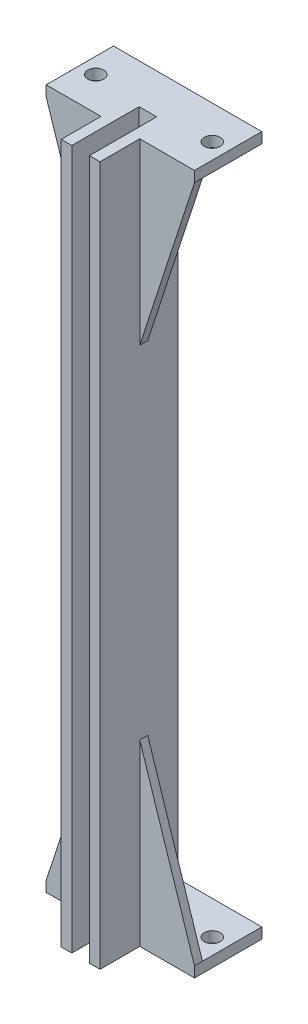
ISO-10303-21;
HEADER;
FILE_DESCRIPTION(('STEP AP214'),'2;1');
FILE_NAME('part.step','',(''),(''),'','','');
FILE_SCHEMA(('AUTOMOTIVE_DESIGN { 1 0 10303 214 1 1 1 1 }'));
ENDSEC;
DATA;
#1=APPLICATION_CONTEXT('core data for automotive mechanical design processes');
#2=APPLICATION_PROTOCOL_DEFINITION('international standard','automotive_design',2000,#1);
#3=PRODUCT_CONTEXT('',#1,'mechanical');
#4=PRODUCT('Part','Part','',(#3));
#5=PRODUCT_RELATED_PRODUCT_CATEGORY('part','',(#4));
#6=PRODUCT_DEFINITION_FORMATION('','',#4);
#7=PRODUCT_DEFINITION_CONTEXT('part definition',#1,'design');
#8=PRODUCT_DEFINITION('design','',#6,#7);
#9=PRODUCT_DEFINITION_SHAPE('','',#8);
#10=(LENGTH_UNIT() NAMED_UNIT(*) SI_UNIT(.MILLI.,.METRE.));
#11=(NAMED_UNIT(*) PLANE_ANGLE_UNIT() SI_UNIT($,.RADIAN.));
#12=(NAMED_UNIT(*) SI_UNIT($,.STERADIAN.) SOLID_ANGLE_UNIT());
#13=UNCERTAINTY_MEASURE_WITH_UNIT(LENGTH_MEASURE(1.E-05),#10,'distance_accuracy_value','');
#14=(GEOMETRIC_REPRESENTATION_CONTEXT(3) GLOBAL_UNCERTAINTY_ASSIGNED_CONTEXT((#13)) GLOBAL_UNIT_ASSIGNED_CONTEXT((#10,
#11,#12)) REPRESENTATION_CONTEXT('',''));
#15=CARTESIAN_POINT('',(0.,0.,0.));
#16=DIRECTION('',(0.,0.,1.));
#17=DIRECTION('',(1.,0.,0.));
#18=AXIS2_PLACEMENT_3D('',#15,#16,#17);
#19=CARTESIAN_POINT('',(-3.6637,2.,0.));
#20=DIRECTION('',(-1.,0.,0.));
#21=DIRECTION('',(0.,0.,1.));
#22=AXIS2_PLACEMENT_3D('',#19,#20,#21);
#23=PLANE('',#22);
#24=DIRECTION('',(0.,0.,1.));
#25=VECTOR('',#24,1.);
#26=CARTESIAN_POINT('',(-3.6637,2.,0.));
#27=LINE('',#26,#25);
#28=CARTESIAN_POINT('',(-3.6637,2.00000000000002,0.));
#29=VERTEX_POINT('',#28);
#30=CARTESIAN_POINT('',(-3.6637,2.,5.6960018));
#31=VERTEX_POINT('',#30);
#32=EDGE_CURVE('E325',#29,#31,#27,.T.);
#33=ORIENTED_EDGE('',*,*,#32,.T.);
#34=DIRECTION('',(0.,-1.,0.));
#35=VECTOR('',#34,1.);
#36=CARTESIAN_POINT('',(-3.6637,2.,5.6960018));
#37=LINE('',#36,#35);
#38=CARTESIAN_POINT('',(-3.6637,33.75,5.6960018));
#39=VERTEX_POINT('',#38);
#40=EDGE_CURVE('E302',#39,#31,#37,.T.);
#41=ORIENTED_EDGE('',*,*,#40,.F.);
#42=DIRECTION('',(0.,0.,1.));
#43=VECTOR('',#42,1.);
#44=CARTESIAN_POINT('',(-3.6637,33.75,5.6960018));
#45=LINE('',#44,#43);
#46=CARTESIAN_POINT('',(-3.6637,33.75,7.1960018));
#47=VERTEX_POINT('',#46);
#48=EDGE_CURVE('E306',#39,#47,#45,.T.);
#49=ORIENTED_EDGE('',*,*,#48,.T.);
#50=DIRECTION('',(0.,-1.,0.));
#51=VECTOR('',#50,1.);
#52=CARTESIAN_POINT('',(-3.6637,2.,7.1960018));
#53=LINE('',#52,#51);
#54=CARTESIAN_POINT('',(-3.6637,0.,7.1960018));
#55=VERTEX_POINT('',#54);
#56=EDGE_CURVE('E433',#47,#55,#53,.T.);
#57=ORIENTED_EDGE('',*,*,#56,.T.);
#58=DIRECTION('',(0.,0.,-1.));
#59=VECTOR('',#58,1.);
#60=CARTESIAN_POINT('',(-3.6637,0.,0.));
#61=LINE('',#60,#59);
#62=CARTESIAN_POINT('',(-3.6637,0.,14.7));
#63=VERTEX_POINT('',#62);
#64=EDGE_CURVE('E371',#63,#55,#61,.T.);
#65=ORIENTED_EDGE('',*,*,#64,.F.);
#66=DIRECTION('',(0.,-1.,0.));
#67=VECTOR('',#66,1.);
#68=CARTESIAN_POINT('',(-3.6637,2.,14.7));
#69=LINE('',#68,#67);
#70=CARTESIAN_POINT('',(-3.6637,132.08,14.7));
#71=VERTEX_POINT('',#70);
#72=EDGE_CURVE('E430',#71,#63,#69,.T.);
#73=ORIENTED_EDGE('',*,*,#72,.F.);
#74=DIRECTION('',(0.,0.,-1.));
#75=VECTOR('',#74,1.);
#76=CARTESIAN_POINT('',(-3.6637,132.08,0.));
#77=LINE('',#76,#75);
#78=CARTESIAN_POINT('',(-3.6637,132.08,7.1960018));
#79=VERTEX_POINT('',#78);
#80=EDGE_CURVE('E1096',#71,#79,#77,.T.);
#81=ORIENTED_EDGE('',*,*,#80,.T.);
#82=DIRECTION('',(0.,1.,0.));
#83=VECTOR('',#82,1.);
#84=CARTESIAN_POINT('',(-3.6637,130.08,7.1960018));
#85=LINE('',#84,#83);
#86=CARTESIAN_POINT('',(-3.6637,98.33,7.1960018));
#87=VERTEX_POINT('',#86);
#88=EDGE_CURVE('E251',#87,#79,#85,.T.);
#89=ORIENTED_EDGE('',*,*,#88,.F.);
#90=DIRECTION('',(0.,0.,1.));
#91=VECTOR('',#90,1.);
#92=CARTESIAN_POINT('',(-3.6637,98.33,5.6960018));
#93=LINE('',#92,#91);
#94=CARTESIAN_POINT('',(-3.6637,98.33,5.6960018));
#95=VERTEX_POINT('',#94);
#96=EDGE_CURVE('E1052',#95,#87,#93,.T.);
#97=ORIENTED_EDGE('',*,*,#96,.F.);
#98=DIRECTION('',(0.,1.,0.));
#99=VECTOR('',#98,1.);
#100=CARTESIAN_POINT('',(-3.6637,130.08,5.6960018));
#101=LINE('',#100,#99);
#102=CARTESIAN_POINT('',(-3.6637,130.08,5.6960018));
#103=VERTEX_POINT('',#102);
#104=EDGE_CURVE('E1048',#95,#103,#101,.T.);
#105=ORIENTED_EDGE('',*,*,#104,.T.);
#106=DIRECTION('',(0.,0.,1.));
#107=VECTOR('',#106,1.);
#108=CARTESIAN_POINT('',(-3.6637,130.08,0.));
#109=LINE('',#108,#107);
#110=CARTESIAN_POINT('',(-3.6637,130.08,0.));
#111=VERTEX_POINT('',#110);
#112=EDGE_CURVE('E1062',#111,#103,#109,.T.);
#113=ORIENTED_EDGE('',*,*,#112,.F.);
#114=DIRECTION('',(0.,-1.,0.));
#115=VECTOR('',#114,1.);
#116=CARTESIAN_POINT('',(-3.6637,38.1,0.));
#117=LINE('',#116,#115);
#118=EDGE_CURVE('E317',#111,#29,#117,.T.);
#119=ORIENTED_EDGE('',*,*,#118,.T.);
#120=EDGE_LOOP('',(#33,#41,#49,#57,#65,#73,#81,#89,#97,#105,#113,#119));
#121=FACE_BOUND('',#120,.T.);
#122=ADVANCED_FACE('F43',(#121),#23,.T.);
#123=CARTESIAN_POINT('',(0.,2.,0.));
#124=DIRECTION('',(0.,1.,0.));
#125=DIRECTION('',(0.,0.,1.));
#126=AXIS2_PLACEMENT_3D('',#123,#124,#125);
#127=PLANE('',#126);
#128=DIRECTION('',(-1.,0.,0.));
#129=VECTOR('',#128,1.);
#130=CARTESIAN_POINT('',(14.,2.,5.6960018));
#131=LINE('',#130,#129);
#132=CARTESIAN_POINT('',(14.,2.,5.6960018));
#133=VERTEX_POINT('',#132);
#134=CARTESIAN_POINT('',(3.6637,2.,5.6960018));
#135=VERTEX_POINT('',#134);
#136=EDGE_CURVE('E59',#133,#135,#131,.T.);
#137=ORIENTED_EDGE('',*,*,#136,.F.);
#138=DIRECTION('',(0.,0.,1.));
#139=VECTOR('',#138,1.);
#140=CARTESIAN_POINT('',(14.,2.,0.));
#141=LINE('',#140,#139);
#142=CARTESIAN_POINT('',(14.,2.,-5.5039982));
#143=VERTEX_POINT('',#142);
#144=EDGE_CURVE('E336',#143,#133,#141,.T.);
#145=ORIENTED_EDGE('',*,*,#144,.F.);
#146=DIRECTION('',(1.,0.,0.));
#147=VECTOR('',#146,1.);
#148=CARTESIAN_POINT('',(0.,2.,-5.5039982));
#149=LINE('',#148,#147);
#150=CARTESIAN_POINT('',(-14.,2.,-5.5039982));
#151=VERTEX_POINT('',#150);
#152=EDGE_CURVE('E339',#151,#143,#149,.T.);
#153=ORIENTED_EDGE('',*,*,#152,.F.);
#154=DIRECTION('',(0.,0.,1.));
#155=VECTOR('',#154,1.);
#156=CARTESIAN_POINT('',(-14.,2.,0.));
#157=LINE('',#156,#155);
#158=CARTESIAN_POINT('',(-14.,2.,5.6960018));
#159=VERTEX_POINT('',#158);
#160=EDGE_CURVE('E344',#151,#159,#157,.T.);
#161=ORIENTED_EDGE('',*,*,#160,.T.);
#162=DIRECTION('',(-1.,0.,0.));
#163=VECTOR('',#162,1.);
#164=CARTESIAN_POINT('',(-14.,2.,5.6960018));
#165=LINE('',#164,#163);
#166=EDGE_CURVE('E294',#31,#159,#165,.T.);
#167=ORIENTED_EDGE('',*,*,#166,.F.);
#168=ORIENTED_EDGE('',*,*,#32,.F.);
#169=DIRECTION('',(-1.,0.,0.));
#170=VECTOR('',#169,1.);
#171=CARTESIAN_POINT('',(0.,2.,0.));
#172=LINE('',#171,#170);
#173=CARTESIAN_POINT('',(3.6637,2.00000000000002,0.));
#174=VERTEX_POINT('',#173);
#175=EDGE_CURVE('E329',#174,#29,#172,.T.);
#176=ORIENTED_EDGE('',*,*,#175,.F.);
#177=DIRECTION('',(0.,0.,-1.));
#178=VECTOR('',#177,1.);
#179=CARTESIAN_POINT('',(3.6637,2.,0.));
#180=LINE('',#179,#178);
#181=EDGE_CURVE('E332',#135,#174,#180,.T.);
#182=ORIENTED_EDGE('',*,*,#181,.F.);
#183=EDGE_LOOP('',(#137,#145,#153,#161,#167,#168,#176,#182));
#184=FACE_BOUND('',#183,.T.);
#185=CARTESIAN_POINT('',(-11.,2.,0.846001800000001));
#186=DIRECTION('',(0.,1.,0.));
#187=DIRECTION('',(0.,0.,1.));
#188=AXIS2_PLACEMENT_3D('',#185,#186,#187);
#189=CIRCLE('',#188,1.5);
#190=CARTESIAN_POINT('',(-11.,2.,2.3460018));
#191=VERTEX_POINT('',#190);
#192=EDGE_CURVE('E348',#191,#191,#189,.T.);
#193=ORIENTED_EDGE('',*,*,#192,.F.);
#194=EDGE_LOOP('',(#193));
#195=FACE_BOUND('',#194,.T.);
#196=CARTESIAN_POINT('',(11.,2.,0.846001800000001));
#197=DIRECTION('',(0.,1.,0.));
#198=DIRECTION('',(0.,0.,1.));
#199=AXIS2_PLACEMENT_3D('',#196,#197,#198);
#200=CIRCLE('',#199,1.5);
#201=CARTESIAN_POINT('',(11.,2.,2.3460018));
#202=VERTEX_POINT('',#201);
#203=EDGE_CURVE('E352',#202,#202,#200,.T.);
#204=ORIENTED_EDGE('',*,*,#203,.F.);
#205=EDGE_LOOP('',(#204));
#206=FACE_BOUND('',#205,.T.);
#207=ADVANCED_FACE('F499',(#184,#195,#206),#127,.T.);
#208=CARTESIAN_POINT('',(14.,2.,0.));
#209=DIRECTION('',(1.,0.,0.));
#210=DIRECTION('',(0.,0.,-1.));
#211=AXIS2_PLACEMENT_3D('',#208,#209,#210);
#212=PLANE('',#211);
#213=DIRECTION('',(0.,0.,1.));
#214=VECTOR('',#213,1.);
#215=CARTESIAN_POINT('',(14.,0.,0.));
#216=LINE('',#215,#214);
#217=CARTESIAN_POINT('',(14.,0.,-5.5039982));
#218=VERTEX_POINT('',#217);
#219=CARTESIAN_POINT('',(14.,0.,7.1960018));
#220=VERTEX_POINT('',#219);
#221=EDGE_CURVE('E335',#218,#220,#216,.T.);
#222=ORIENTED_EDGE('',*,*,#221,.F.);
#223=DIRECTION('',(0.,-1.,0.));
#224=VECTOR('',#223,1.);
#225=CARTESIAN_POINT('',(14.,2.,-5.5039982));
#226=LINE('',#225,#224);
#227=EDGE_CURVE('E11',#143,#218,#226,.T.);
#228=ORIENTED_EDGE('',*,*,#227,.F.);
#229=ORIENTED_EDGE('',*,*,#144,.T.);
#230=DIRECTION('',(0.,0.,1.));
#231=VECTOR('',#230,1.);
#232=CARTESIAN_POINT('',(14.,2.,5.6960018));
#233=LINE('',#232,#231);
#234=CARTESIAN_POINT('',(14.,2.,7.1960018));
#235=VERTEX_POINT('',#234);
#236=EDGE_CURVE('E289',#133,#235,#233,.T.);
#237=ORIENTED_EDGE('',*,*,#236,.T.);
#238=DIRECTION('',(0.,-1.,0.));
#239=VECTOR('',#238,1.);
#240=CARTESIAN_POINT('',(14.,2.,7.1960018));
#241=LINE('',#240,#239);
#242=EDGE_CURVE('E356',#235,#220,#241,.T.);
#243=ORIENTED_EDGE('',*,*,#242,.T.);
#244=EDGE_LOOP('',(#222,#228,#229,#237,#243));
#245=FACE_BOUND('',#244,.T.);
#246=ADVANCED_FACE('F45',(#245),#212,.T.);
#247=CARTESIAN_POINT('',(0.,2.,-5.5039982));
#248=DIRECTION('',(0.,0.,-1.));
#249=DIRECTION('',(-1.,0.,0.));
#250=AXIS2_PLACEMENT_3D('',#247,#248,#249);
#251=PLANE('',#250);
#252=DIRECTION('',(1.,0.,0.));
#253=VECTOR('',#252,1.);
#254=CARTESIAN_POINT('',(0.,0.,-5.5039982));
#255=LINE('',#254,#253);
#256=CARTESIAN_POINT('',(-14.,0.,-5.5039982));
#257=VERTEX_POINT('',#256);
#258=EDGE_CURVE('E360',#257,#218,#255,.T.);
#259=ORIENTED_EDGE('',*,*,#258,.F.);
#260=DIRECTION('',(0.,-1.,0.));
#261=VECTOR('',#260,1.);
#262=CARTESIAN_POINT('',(-14.,2.,-5.5039982));
#263=LINE('',#262,#261);
#264=EDGE_CURVE('E52',#151,#257,#263,.T.);
#265=ORIENTED_EDGE('',*,*,#264,.F.);
#266=ORIENTED_EDGE('',*,*,#152,.T.);
#267=ORIENTED_EDGE('',*,*,#227,.T.);
#268=EDGE_LOOP('',(#259,#265,#266,#267));
#269=FACE_BOUND('',#268,.T.);
#270=ADVANCED_FACE('F452',(#269),#251,.T.);
#271=CARTESIAN_POINT('',(-14.,2.,0.));
#272=DIRECTION('',(1.,0.,0.));
#273=DIRECTION('',(0.,0.,-1.));
#274=AXIS2_PLACEMENT_3D('',#271,#272,#273);
#275=PLANE('',#274);
#276=DIRECTION('',(0.,0.,1.));
#277=VECTOR('',#276,1.);
#278=CARTESIAN_POINT('',(-14.,0.,0.));
#279=LINE('',#278,#277);
#280=CARTESIAN_POINT('',(-14.,0.,7.1960018));
#281=VERTEX_POINT('',#280);
#282=EDGE_CURVE('E364',#257,#281,#279,.T.);
#283=ORIENTED_EDGE('',*,*,#282,.T.);
#284=DIRECTION('',(0.,-1.,0.));
#285=VECTOR('',#284,1.);
#286=CARTESIAN_POINT('',(-14.,2.,7.1960018));
#287=LINE('',#286,#285);
#288=CARTESIAN_POINT('',(-14.,2.,7.1960018));
#289=VERTEX_POINT('',#288);
#290=EDGE_CURVE('E436',#289,#281,#287,.T.);
#291=ORIENTED_EDGE('',*,*,#290,.F.);
#292=DIRECTION('',(0.,0.,1.));
#293=VECTOR('',#292,1.);
#294=CARTESIAN_POINT('',(-14.,2.,5.6960018));
#295=LINE('',#294,#293);
#296=EDGE_CURVE('E313',#159,#289,#295,.T.);
#297=ORIENTED_EDGE('',*,*,#296,.F.);
#298=ORIENTED_EDGE('',*,*,#160,.F.);
#299=ORIENTED_EDGE('',*,*,#264,.T.);
#300=EDGE_LOOP('',(#283,#291,#297,#298,#299));
#301=FACE_BOUND('',#300,.T.);
#302=ADVANCED_FACE('F443',(#301),#275,.F.);
#303=CARTESIAN_POINT('',(0.,2.,7.1960018));
#304=DIRECTION('',(0.,0.,-1.));
#305=DIRECTION('',(-1.,0.,0.));
#306=AXIS2_PLACEMENT_3D('',#303,#304,#305);
#307=PLANE('',#306);
#308=DIRECTION('',(1.,0.,0.));
#309=VECTOR('',#308,1.);
#310=CARTESIAN_POINT('',(0.,0.,7.1960018));
#311=LINE('',#310,#309);
#312=EDGE_CURVE('E367',#281,#55,#311,.T.);
#313=ORIENTED_EDGE('',*,*,#312,.T.);
#314=ORIENTED_EDGE('',*,*,#56,.F.);
#315=DIRECTION('',(0.309561424772771,0.950879447823252,0.));
#316=VECTOR('',#315,1.);
#317=CARTESIAN_POINT('',(-3.6637,33.75,7.1960018));
#318=LINE('',#317,#316);
#319=EDGE_CURVE('E293',#289,#47,#318,.T.);
#320=ORIENTED_EDGE('',*,*,#319,.F.);
#321=ORIENTED_EDGE('',*,*,#290,.T.);
#322=EDGE_LOOP('',(#313,#314,#320,#321));
#323=FACE_BOUND('',#322,.T.);
#324=ADVANCED_FACE('F496',(#323),#307,.F.);
#325=CARTESIAN_POINT('',(0.,2.,14.7));
#326=DIRECTION('',(0.,0.,1.));
#327=DIRECTION('',(1.,0.,0.));
#328=AXIS2_PLACEMENT_3D('',#325,#326,#327);
#329=PLANE('',#328);
#330=DIRECTION('',(-1.,0.,0.));
#331=VECTOR('',#330,1.);
#332=CARTESIAN_POINT('',(0.,0.,14.7));
#333=LINE('',#332,#331);
#334=CARTESIAN_POINT('',(-1.6637,0.,14.7));
#335=VERTEX_POINT('',#334);
#336=EDGE_CURVE('E375',#335,#63,#333,.T.);
#337=ORIENTED_EDGE('',*,*,#336,.F.);
#338=DIRECTION('',(0.,-1.,0.));
#339=VECTOR('',#338,1.);
#340=CARTESIAN_POINT('',(-1.6637,2.,14.7));
#341=LINE('',#340,#339);
#342=CARTESIAN_POINT('',(-1.6637,132.08,14.7));
#343=VERTEX_POINT('',#342);
#344=EDGE_CURVE('E427',#343,#335,#341,.T.);
#345=ORIENTED_EDGE('',*,*,#344,.F.);
#346=DIRECTION('',(-1.,0.,0.));
#347=VECTOR('',#346,1.);
#348=CARTESIAN_POINT('',(0.,132.08,14.7));
#349=LINE('',#348,#347);
#350=EDGE_CURVE('E489',#343,#71,#349,.T.);
#351=ORIENTED_EDGE('',*,*,#350,.T.);
#352=ORIENTED_EDGE('',*,*,#72,.T.);
#353=EDGE_LOOP('',(#337,#345,#351,#352));
#354=FACE_BOUND('',#353,.T.);
#355=ADVANCED_FACE('F486',(#354),#329,.T.);
#356=CARTESIAN_POINT('',(-1.6637,2.,0.));
#357=DIRECTION('',(1.,0.,0.));
#358=DIRECTION('',(0.,0.,-1.));
#359=AXIS2_PLACEMENT_3D('',#356,#357,#358);
#360=PLANE('',#359);
#361=DIRECTION('',(0.,0.,1.));
#362=VECTOR('',#361,1.);
#363=CARTESIAN_POINT('',(-1.6637,0.,0.));
#364=LINE('',#363,#362);
#365=CARTESIAN_POINT('',(-1.6637,0.,2.));
#366=VERTEX_POINT('',#365);
#367=EDGE_CURVE('E379',#366,#335,#364,.T.);
#368=ORIENTED_EDGE('',*,*,#367,.F.);
#369=DIRECTION('',(0.,-1.,0.));
#370=VECTOR('',#369,1.);
#371=CARTESIAN_POINT('',(-1.6637,2.,2.));
#372=LINE('',#371,#370);
#373=CARTESIAN_POINT('',(-1.6637,132.08,2.));
#374=VERTEX_POINT('',#373);
#375=EDGE_CURVE('E424',#374,#366,#372,.T.);
#376=ORIENTED_EDGE('',*,*,#375,.F.);
#377=DIRECTION('',(0.,0.,1.));
#378=VECTOR('',#377,1.);
#379=CARTESIAN_POINT('',(-1.6637,132.08,0.));
#380=LINE('',#379,#378);
#381=EDGE_CURVE('E1101',#374,#343,#380,.T.);
#382=ORIENTED_EDGE('',*,*,#381,.T.);
#383=ORIENTED_EDGE('',*,*,#344,.T.);
#384=EDGE_LOOP('',(#368,#376,#382,#383));
#385=FACE_BOUND('',#384,.T.);
#386=ADVANCED_FACE('F482',(#385),#360,.T.);
#387=CARTESIAN_POINT('',(0.,2.,2.));
#388=DIRECTION('',(0.,0.,1.));
#389=DIRECTION('',(1.,0.,0.));
#390=AXIS2_PLACEMENT_3D('',#387,#388,#389);
#391=PLANE('',#390);
#392=DIRECTION('',(-1.,0.,0.));
#393=VECTOR('',#392,1.);
#394=CARTESIAN_POINT('',(0.,0.,2.));
#395=LINE('',#394,#393);
#396=CARTESIAN_POINT('',(1.6637,0.,2.));
#397=VERTEX_POINT('',#396);
#398=EDGE_CURVE('E383',#397,#366,#395,.T.);
#399=ORIENTED_EDGE('',*,*,#398,.F.);
#400=DIRECTION('',(0.,-1.,0.));
#401=VECTOR('',#400,1.);
#402=CARTESIAN_POINT('',(1.6637,2.,2.));
#403=LINE('',#402,#401);
#404=CARTESIAN_POINT('',(1.6637,132.08,2.));
#405=VERTEX_POINT('',#404);
#406=EDGE_CURVE('E421',#405,#397,#403,.T.);
#407=ORIENTED_EDGE('',*,*,#406,.F.);
#408=DIRECTION('',(-1.,0.,0.));
#409=VECTOR('',#408,1.);
#410=CARTESIAN_POINT('',(0.,132.08,2.));
#411=LINE('',#410,#409);
#412=EDGE_CURVE('E478',#405,#374,#411,.T.);
#413=ORIENTED_EDGE('',*,*,#412,.T.);
#414=ORIENTED_EDGE('',*,*,#375,.T.);
#415=EDGE_LOOP('',(#399,#407,#413,#414));
#416=FACE_BOUND('',#415,.T.);
#417=ADVANCED_FACE('F476',(#416),#391,.T.);
#418=CARTESIAN_POINT('',(1.6637,2.,0.));
#419=DIRECTION('',(-1.,0.,0.));
#420=DIRECTION('',(0.,0.,1.));
#421=AXIS2_PLACEMENT_3D('',#418,#419,#420);
#422=PLANE('',#421);
#423=DIRECTION('',(0.,0.,-1.));
#424=VECTOR('',#423,1.);
#425=CARTESIAN_POINT('',(1.6637,0.,0.));
#426=LINE('',#425,#424);
#427=CARTESIAN_POINT('',(1.6637,0.,14.7));
#428=VERTEX_POINT('',#427);
#429=EDGE_CURVE('E387',#428,#397,#426,.T.);
#430=ORIENTED_EDGE('',*,*,#429,.F.);
#431=DIRECTION('',(0.,-1.,0.));
#432=VECTOR('',#431,1.);
#433=CARTESIAN_POINT('',(1.6637,2.,14.7));
#434=LINE('',#433,#432);
#435=CARTESIAN_POINT('',(1.6637,132.08,14.7));
#436=VERTEX_POINT('',#435);
#437=EDGE_CURVE('E418',#436,#428,#434,.T.);
#438=ORIENTED_EDGE('',*,*,#437,.F.);
#439=DIRECTION('',(0.,0.,-1.));
#440=VECTOR('',#439,1.);
#441=CARTESIAN_POINT('',(1.6637,132.08,0.));
#442=LINE('',#441,#440);
#443=EDGE_CURVE('E472',#436,#405,#442,.T.);
#444=ORIENTED_EDGE('',*,*,#443,.T.);
#445=ORIENTED_EDGE('',*,*,#406,.T.);
#446=EDGE_LOOP('',(#430,#438,#444,#445));
#447=FACE_BOUND('',#446,.T.);
#448=ADVANCED_FACE('F469',(#447),#422,.T.);
#449=CARTESIAN_POINT('',(0.,2.,14.7));
#450=DIRECTION('',(0.,0.,1.));
#451=DIRECTION('',(1.,0.,0.));
#452=AXIS2_PLACEMENT_3D('',#449,#450,#451);
#453=PLANE('',#452);
#454=DIRECTION('',(-1.,0.,0.));
#455=VECTOR('',#454,1.);
#456=CARTESIAN_POINT('',(0.,0.,14.7));
#457=LINE('',#456,#455);
#458=CARTESIAN_POINT('',(3.6637,0.,14.7));
#459=VERTEX_POINT('',#458);
#460=EDGE_CURVE('E391',#459,#428,#457,.T.);
#461=ORIENTED_EDGE('',*,*,#460,.F.);
#462=DIRECTION('',(0.,-1.,0.));
#463=VECTOR('',#462,1.);
#464=CARTESIAN_POINT('',(3.6637,2.,14.7));
#465=LINE('',#464,#463);
#466=CARTESIAN_POINT('',(3.6637,132.08,14.7));
#467=VERTEX_POINT('',#466);
#468=EDGE_CURVE('E415',#467,#459,#465,.T.);
#469=ORIENTED_EDGE('',*,*,#468,.F.);
#470=DIRECTION('',(-1.,0.,0.));
#471=VECTOR('',#470,1.);
#472=CARTESIAN_POINT('',(0.,132.08,14.7));
#473=LINE('',#472,#471);
#474=EDGE_CURVE('E1108',#467,#436,#473,.T.);
#475=ORIENTED_EDGE('',*,*,#474,.T.);
#476=ORIENTED_EDGE('',*,*,#437,.T.);
#477=EDGE_LOOP('',(#461,#469,#475,#476));
#478=FACE_BOUND('',#477,.T.);
#479=ADVANCED_FACE('F465',(#478),#453,.T.);
#480=CARTESIAN_POINT('',(3.6637,2.,0.));
#481=DIRECTION('',(1.,0.,0.));
#482=DIRECTION('',(0.,0.,-1.));
#483=AXIS2_PLACEMENT_3D('',#480,#481,#482);
#484=PLANE('',#483);
#485=DIRECTION('',(0.,1.,0.));
#486=VECTOR('',#485,1.);
#487=CARTESIAN_POINT('',(3.6637,2.,5.6960018));
#488=LINE('',#487,#486);
#489=CARTESIAN_POINT('',(3.6637,33.75,5.6960018));
#490=VERTEX_POINT('',#489);
#491=EDGE_CURVE('E281',#135,#490,#488,.T.);
#492=ORIENTED_EDGE('',*,*,#491,.F.);
#493=ORIENTED_EDGE('',*,*,#181,.T.);
#494=DIRECTION('',(0.,-1.,0.));
#495=VECTOR('',#494,1.);
#496=CARTESIAN_POINT('',(3.6637,38.1,0.));
#497=LINE('',#496,#495);
#498=CARTESIAN_POINT('',(3.6637,130.08,0.));
#499=VERTEX_POINT('',#498);
#500=EDGE_CURVE('E321',#499,#174,#497,.T.);
#501=ORIENTED_EDGE('',*,*,#500,.F.);
#502=DIRECTION('',(0.,0.,-1.));
#503=VECTOR('',#502,1.);
#504=CARTESIAN_POINT('',(3.6637,130.08,0.));
#505=LINE('',#504,#503);
#506=CARTESIAN_POINT('',(3.6637,130.08,5.6960018));
#507=VERTEX_POINT('',#506);
#508=EDGE_CURVE('E515',#507,#499,#505,.T.);
#509=ORIENTED_EDGE('',*,*,#508,.F.);
#510=DIRECTION('',(0.,-1.,0.));
#511=VECTOR('',#510,1.);
#512=CARTESIAN_POINT('',(3.6637,130.08,5.6960018));
#513=LINE('',#512,#511);
#514=CARTESIAN_POINT('',(3.6637,98.33,5.6960018));
#515=VERTEX_POINT('',#514);
#516=EDGE_CURVE('E1030',#507,#515,#513,.T.);
#517=ORIENTED_EDGE('',*,*,#516,.T.);
#518=DIRECTION('',(0.,0.,1.));
#519=VECTOR('',#518,1.);
#520=CARTESIAN_POINT('',(3.6637,98.33,5.6960018));
#521=LINE('',#520,#519);
#522=CARTESIAN_POINT('',(3.6637,98.33,7.1960018));
#523=VERTEX_POINT('',#522);
#524=EDGE_CURVE('E240',#515,#523,#521,.T.);
#525=ORIENTED_EDGE('',*,*,#524,.T.);
#526=DIRECTION('',(0.,1.,0.));
#527=VECTOR('',#526,1.);
#528=CARTESIAN_POINT('',(3.6637,130.08,7.1960018));
#529=LINE('',#528,#527);
#530=CARTESIAN_POINT('',(3.6637,132.08,7.1960018));
#531=VERTEX_POINT('',#530);
#532=EDGE_CURVE('E225',#523,#531,#529,.T.);
#533=ORIENTED_EDGE('',*,*,#532,.T.);
#534=DIRECTION('',(0.,0.,1.));
#535=VECTOR('',#534,1.);
#536=CARTESIAN_POINT('',(3.6637,132.08,0.));
#537=LINE('',#536,#535);
#538=EDGE_CURVE('E461',#531,#467,#537,.T.);
#539=ORIENTED_EDGE('',*,*,#538,.T.);
#540=ORIENTED_EDGE('',*,*,#468,.T.);
#541=DIRECTION('',(0.,0.,1.));
#542=VECTOR('',#541,1.);
#543=CARTESIAN_POINT('',(3.6637,0.,0.));
#544=LINE('',#543,#542);
#545=CARTESIAN_POINT('',(3.6637,0.,7.1960018));
#546=VERTEX_POINT('',#545);
#547=EDGE_CURVE('E395',#546,#459,#544,.T.);
#548=ORIENTED_EDGE('',*,*,#547,.F.);
#549=DIRECTION('',(0.,-1.,0.));
#550=VECTOR('',#549,1.);
#551=CARTESIAN_POINT('',(3.6637,2.,7.1960018));
#552=LINE('',#551,#550);
#553=CARTESIAN_POINT('',(3.6637,33.75,7.1960018));
#554=VERTEX_POINT('',#553);
#555=EDGE_CURVE('E412',#554,#546,#552,.T.);
#556=ORIENTED_EDGE('',*,*,#555,.F.);
#557=DIRECTION('',(0.,0.,1.));
#558=VECTOR('',#557,1.);
#559=CARTESIAN_POINT('',(3.6637,33.75,5.6960018));
#560=LINE('',#559,#558);
#561=EDGE_CURVE('E67',#490,#554,#560,.T.);
#562=ORIENTED_EDGE('',*,*,#561,.F.);
#563=EDGE_LOOP('',(#492,#493,#501,#509,#517,#525,#533,#539,#540,#548,#556,#562));
#564=FACE_BOUND('',#563,.T.);
#565=ADVANCED_FACE('F457',(#564),#484,.T.);
#566=CARTESIAN_POINT('',(-11.,2.,0.846001800000001));
#567=DIRECTION('',(0.,-1.,0.));
#568=DIRECTION('',(0.,0.,-1.));
#569=AXIS2_PLACEMENT_3D('',#566,#567,#568);
#570=CYLINDRICAL_SURFACE('',#569,1.5);
#571=ORIENTED_EDGE('',*,*,#192,.T.);
#572=EDGE_LOOP('',(#571));
#573=FACE_BOUND('',#572,.T.);
#574=CARTESIAN_POINT('',(-11.,0.,0.846001800000001));
#575=DIRECTION('',(0.,1.,0.));
#576=DIRECTION('',(0.,0.,1.));
#577=AXIS2_PLACEMENT_3D('',#574,#575,#576);
#578=CIRCLE('',#577,1.5);
#579=CARTESIAN_POINT('',(-11.,0.,2.3460018));
#580=VERTEX_POINT('',#579);
#581=EDGE_CURVE('E403',#580,#580,#578,.T.);
#582=ORIENTED_EDGE('',*,*,#581,.F.);
#583=EDGE_LOOP('',(#582));
#584=FACE_BOUND('',#583,.T.);
#585=ADVANCED_FACE('F527',(#573,#584),#570,.F.);
#586=CARTESIAN_POINT('',(0.,2.,7.1960018));
#587=DIRECTION('',(0.,0.,-1.));
#588=DIRECTION('',(-1.,0.,0.));
#589=AXIS2_PLACEMENT_3D('',#586,#587,#588);
#590=PLANE('',#589);
#591=DIRECTION('',(1.,0.,0.));
#592=VECTOR('',#591,1.);
#593=CARTESIAN_POINT('',(0.,0.,7.1960018));
#594=LINE('',#593,#592);
#595=EDGE_CURVE('E399',#546,#220,#594,.T.);
#596=ORIENTED_EDGE('',*,*,#595,.T.);
#597=ORIENTED_EDGE('',*,*,#242,.F.);
#598=DIRECTION('',(0.309561424772771,-0.950879447823252,0.));
#599=VECTOR('',#598,1.);
#600=CARTESIAN_POINT('',(3.6637,33.75,7.1960018));
#601=LINE('',#600,#599);
#602=EDGE_CURVE('E274',#554,#235,#601,.T.);
#603=ORIENTED_EDGE('',*,*,#602,.F.);
#604=ORIENTED_EDGE('',*,*,#555,.T.);
#605=EDGE_LOOP('',(#596,#597,#603,#604));
#606=FACE_BOUND('',#605,.T.);
#607=ADVANCED_FACE('F524',(#606),#590,.F.);
#608=CARTESIAN_POINT('',(11.,2.,0.846001800000001));
#609=DIRECTION('',(0.,-1.,0.));
#610=DIRECTION('',(0.,0.,-1.));
#611=AXIS2_PLACEMENT_3D('',#608,#609,#610);
#612=CYLINDRICAL_SURFACE('',#611,1.5);
#613=ORIENTED_EDGE('',*,*,#203,.T.);
#614=EDGE_LOOP('',(#613));
#615=FACE_BOUND('',#614,.T.);
#616=CARTESIAN_POINT('',(11.,0.,0.846001800000001));
#617=DIRECTION('',(0.,1.,0.));
#618=DIRECTION('',(0.,0.,1.));
#619=AXIS2_PLACEMENT_3D('',#616,#617,#618);
#620=CIRCLE('',#619,1.5);
#621=CARTESIAN_POINT('',(11.,0.,2.3460018));
#622=VERTEX_POINT('',#621);
#623=EDGE_CURVE('E340',#622,#622,#620,.T.);
#624=ORIENTED_EDGE('',*,*,#623,.F.);
#625=EDGE_LOOP('',(#624));
#626=FACE_BOUND('',#625,.T.);
#627=ADVANCED_FACE('F526',(#615,#626),#612,.F.);
#628=CARTESIAN_POINT('',(0.,0.,0.));
#629=DIRECTION('',(0.,1.,0.));
#630=DIRECTION('',(0.,0.,1.));
#631=AXIS2_PLACEMENT_3D('',#628,#629,#630);
#632=PLANE('',#631);
#633=ORIENTED_EDGE('',*,*,#595,.F.);
#634=ORIENTED_EDGE('',*,*,#547,.T.);
#635=ORIENTED_EDGE('',*,*,#460,.T.);
#636=ORIENTED_EDGE('',*,*,#429,.T.);
#637=ORIENTED_EDGE('',*,*,#398,.T.);
#638=ORIENTED_EDGE('',*,*,#367,.T.);
#639=ORIENTED_EDGE('',*,*,#336,.T.);
#640=ORIENTED_EDGE('',*,*,#64,.T.);
#641=ORIENTED_EDGE('',*,*,#312,.F.);
#642=ORIENTED_EDGE('',*,*,#282,.F.);
#643=ORIENTED_EDGE('',*,*,#258,.T.);
#644=ORIENTED_EDGE('',*,*,#221,.T.);
#645=EDGE_LOOP('',(#633,#634,#635,#636,#637,#638,#639,#640,#641,#642,#643,#644));
#646=FACE_BOUND('',#645,.T.);
#647=ORIENTED_EDGE('',*,*,#581,.T.);
#648=EDGE_LOOP('',(#647));
#649=FACE_BOUND('',#648,.T.);
#650=ORIENTED_EDGE('',*,*,#623,.T.);
#651=EDGE_LOOP('',(#650));
#652=FACE_BOUND('',#651,.T.);
#653=ADVANCED_FACE('F450',(#646,#649,#652),#632,.F.);
#654=CARTESIAN_POINT('',(0.,38.1,0.));
#655=DIRECTION('',(0.,0.,-1.));
#656=DIRECTION('',(-1.,0.,0.));
#657=AXIS2_PLACEMENT_3D('',#654,#655,#656);
#658=PLANE('',#657);
#659=ORIENTED_EDGE('',*,*,#500,.T.);
#660=ORIENTED_EDGE('',*,*,#175,.T.);
#661=ORIENTED_EDGE('',*,*,#118,.F.);
#662=DIRECTION('',(-1.,0.,0.));
#663=VECTOR('',#662,1.);
#664=CARTESIAN_POINT('',(0.,130.08,0.));
#665=LINE('',#664,#663);
#666=EDGE_CURVE('E511',#499,#111,#665,.T.);
#667=ORIENTED_EDGE('',*,*,#666,.F.);
#668=EDGE_LOOP('',(#659,#660,#661,#667));
#669=FACE_BOUND('',#668,.T.);
#670=ADVANCED_FACE('F508',(#669),#658,.T.);
#671=CARTESIAN_POINT('',(-3.6637,33.75,5.6960018));
#672=DIRECTION('',(0.950879447823252,-0.309561424772771,0.));
#673=DIRECTION('',(0.309561424772771,0.950879447823252,0.));
#674=AXIS2_PLACEMENT_3D('',#671,#672,#673);
#675=PLANE('',#674);
#676=ORIENTED_EDGE('',*,*,#319,.T.);
#677=ORIENTED_EDGE('',*,*,#48,.F.);
#678=DIRECTION('',(0.309561424772771,0.950879447823252,0.));
#679=VECTOR('',#678,1.);
#680=CARTESIAN_POINT('',(-3.6637,33.75,5.6960018));
#681=LINE('',#680,#679);
#682=EDGE_CURVE('E298',#159,#39,#681,.T.);
#683=ORIENTED_EDGE('',*,*,#682,.F.);
#684=ORIENTED_EDGE('',*,*,#296,.T.);
#685=EDGE_LOOP('',(#676,#677,#683,#684));
#686=FACE_BOUND('',#685,.T.);
#687=ADVANCED_FACE('F502',(#686),#675,.F.);
#688=CARTESIAN_POINT('',(0.,0.,5.6960018));
#689=DIRECTION('',(0.,0.,1.));
#690=DIRECTION('',(1.,0.,0.));
#691=AXIS2_PLACEMENT_3D('',#688,#689,#690);
#692=PLANE('',#691);
#693=ORIENTED_EDGE('',*,*,#166,.T.);
#694=ORIENTED_EDGE('',*,*,#682,.T.);
#695=ORIENTED_EDGE('',*,*,#40,.T.);
#696=EDGE_LOOP('',(#693,#694,#695));
#697=FACE_BOUND('',#696,.T.);
#698=ADVANCED_FACE('F504',(#697),#692,.F.);
#699=CARTESIAN_POINT('',(3.6637,33.75,5.6960018));
#700=DIRECTION('',(-0.950879447823252,-0.309561424772771,0.));
#701=DIRECTION('',(0.309561424772771,-0.950879447823252,0.));
#702=AXIS2_PLACEMENT_3D('',#699,#700,#701);
#703=PLANE('',#702);
#704=ORIENTED_EDGE('',*,*,#602,.T.);
#705=ORIENTED_EDGE('',*,*,#236,.F.);
#706=DIRECTION('',(0.309561424772771,-0.950879447823252,0.));
#707=VECTOR('',#706,1.);
#708=CARTESIAN_POINT('',(3.6637,33.75,5.6960018));
#709=LINE('',#708,#707);
#710=EDGE_CURVE('E275',#490,#133,#709,.T.);
#711=ORIENTED_EDGE('',*,*,#710,.F.);
#712=ORIENTED_EDGE('',*,*,#561,.T.);
#713=EDGE_LOOP('',(#704,#705,#711,#712));
#714=FACE_BOUND('',#713,.T.);
#715=ADVANCED_FACE('F522',(#714),#703,.F.);
#716=CARTESIAN_POINT('',(0.,0.,5.6960018));
#717=DIRECTION('',(0.,0.,-1.));
#718=DIRECTION('',(-1.,0.,0.));
#719=AXIS2_PLACEMENT_3D('',#716,#717,#718);
#720=PLANE('',#719);
#721=ORIENTED_EDGE('',*,*,#710,.T.);
#722=ORIENTED_EDGE('',*,*,#136,.T.);
#723=ORIENTED_EDGE('',*,*,#491,.T.);
#724=EDGE_LOOP('',(#721,#722,#723));
#725=FACE_BOUND('',#724,.T.);
#726=ADVANCED_FACE('F519',(#725),#720,.T.);
#727=CARTESIAN_POINT('',(0.,130.08,0.));
#728=DIRECTION('',(0.,-1.,0.));
#729=DIRECTION('',(0.,0.,1.));
#730=AXIS2_PLACEMENT_3D('',#727,#728,#729);
#731=PLANE('',#730);
#732=DIRECTION('',(-1.,0.,0.));
#733=VECTOR('',#732,1.);
#734=CARTESIAN_POINT('',(14.,130.08,5.6960018));
#735=LINE('',#734,#733);
#736=CARTESIAN_POINT('',(14.,130.08,5.6960018));
#737=VERTEX_POINT('',#736);
#738=EDGE_CURVE('E1031',#737,#507,#735,.T.);
#739=ORIENTED_EDGE('',*,*,#738,.T.);
#740=ORIENTED_EDGE('',*,*,#508,.T.);
#741=ORIENTED_EDGE('',*,*,#666,.T.);
#742=ORIENTED_EDGE('',*,*,#112,.T.);
#743=DIRECTION('',(-1.,0.,0.));
#744=VECTOR('',#743,1.);
#745=CARTESIAN_POINT('',(-14.,130.08,5.6960018));
#746=LINE('',#745,#744);
#747=CARTESIAN_POINT('',(-14.,130.08,5.6960018));
#748=VERTEX_POINT('',#747);
#749=EDGE_CURVE('E1041',#103,#748,#746,.T.);
#750=ORIENTED_EDGE('',*,*,#749,.T.);
#751=DIRECTION('',(0.,0.,1.));
#752=VECTOR('',#751,1.);
#753=CARTESIAN_POINT('',(-14.,130.08,0.));
#754=LINE('',#753,#752);
#755=CARTESIAN_POINT('',(-14.,130.08,-5.5039982));
#756=VERTEX_POINT('',#755);
#757=EDGE_CURVE('E1077',#756,#748,#754,.T.);
#758=ORIENTED_EDGE('',*,*,#757,.F.);
#759=DIRECTION('',(1.,0.,0.));
#760=VECTOR('',#759,1.);
#761=CARTESIAN_POINT('',(0.,130.08,-5.5039982));
#762=LINE('',#761,#760);
#763=CARTESIAN_POINT('',(14.,130.08,-5.5039982));
#764=VERTEX_POINT('',#763);
#765=EDGE_CURVE('E1073',#756,#764,#762,.T.);
#766=ORIENTED_EDGE('',*,*,#765,.T.);
#767=DIRECTION('',(0.,0.,1.));
#768=VECTOR('',#767,1.);
#769=CARTESIAN_POINT('',(14.,130.08,0.));
#770=LINE('',#769,#768);
#771=EDGE_CURVE('E1070',#764,#737,#770,.T.);
#772=ORIENTED_EDGE('',*,*,#771,.T.);
#773=EDGE_LOOP('',(#739,#740,#741,#742,#750,#758,#766,#772));
#774=FACE_BOUND('',#773,.T.);
#775=CARTESIAN_POINT('',(-11.,130.08,0.846001800000001));
#776=DIRECTION('',(0.,1.,0.));
#777=DIRECTION('',(0.,0.,1.));
#778=AXIS2_PLACEMENT_3D('',#775,#776,#777);
#779=CIRCLE('',#778,1.5);
#780=CARTESIAN_POINT('',(-11.,130.08,2.3460018));
#781=VERTEX_POINT('',#780);
#782=EDGE_CURVE('E254',#781,#781,#779,.T.);
#783=ORIENTED_EDGE('',*,*,#782,.T.);
#784=EDGE_LOOP('',(#783));
#785=FACE_BOUND('',#784,.T.);
#786=CARTESIAN_POINT('',(11.,130.08,0.846001800000001));
#787=DIRECTION('',(0.,1.,0.));
#788=DIRECTION('',(0.,0.,1.));
#789=AXIS2_PLACEMENT_3D('',#786,#787,#788);
#790=CIRCLE('',#789,1.5);
#791=CARTESIAN_POINT('',(11.,130.08,2.3460018));
#792=VERTEX_POINT('',#791);
#793=EDGE_CURVE('E247',#792,#792,#790,.T.);
#794=ORIENTED_EDGE('',*,*,#793,.T.);
#795=EDGE_LOOP('',(#794));
#796=FACE_BOUND('',#795,.T.);
#797=ADVANCED_FACE('F734',(#774,#785,#796),#731,.T.);
#798=CARTESIAN_POINT('',(14.,130.08,0.));
#799=DIRECTION('',(1.,0.,0.));
#800=DIRECTION('',(0.,0.,-1.));
#801=AXIS2_PLACEMENT_3D('',#798,#799,#800);
#802=PLANE('',#801);
#803=DIRECTION('',(0.,0.,1.));
#804=VECTOR('',#803,1.);
#805=CARTESIAN_POINT('',(14.,132.08,0.));
#806=LINE('',#805,#804);
#807=CARTESIAN_POINT('',(14.,132.08,-5.5039982));
#808=VERTEX_POINT('',#807);
#809=CARTESIAN_POINT('',(14.,132.08,7.1960018));
#810=VERTEX_POINT('',#809);
#811=EDGE_CURVE('E245',#808,#810,#806,.T.);
#812=ORIENTED_EDGE('',*,*,#811,.T.);
#813=DIRECTION('',(0.,1.,0.));
#814=VECTOR('',#813,1.);
#815=CARTESIAN_POINT('',(14.,130.08,7.1960018));
#816=LINE('',#815,#814);
#817=CARTESIAN_POINT('',(14.,130.08,7.1960018));
#818=VERTEX_POINT('',#817);
#819=EDGE_CURVE('E222',#818,#810,#816,.T.);
#820=ORIENTED_EDGE('',*,*,#819,.F.);
#821=DIRECTION('',(0.,0.,1.));
#822=VECTOR('',#821,1.);
#823=CARTESIAN_POINT('',(14.,130.08,5.6960018));
#824=LINE('',#823,#822);
#825=EDGE_CURVE('E233',#737,#818,#824,.T.);
#826=ORIENTED_EDGE('',*,*,#825,.F.);
#827=ORIENTED_EDGE('',*,*,#771,.F.);
#828=DIRECTION('',(0.,1.,0.));
#829=VECTOR('',#828,1.);
#830=CARTESIAN_POINT('',(14.,130.08,-5.5039982));
#831=LINE('',#830,#829);
#832=EDGE_CURVE('E271',#764,#808,#831,.T.);
#833=ORIENTED_EDGE('',*,*,#832,.T.);
#834=EDGE_LOOP('',(#812,#820,#826,#827,#833));
#835=FACE_BOUND('',#834,.T.);
#836=ADVANCED_FACE('F242',(#835),#802,.T.);
#837=CARTESIAN_POINT('',(0.,130.08,-5.5039982));
#838=DIRECTION('',(0.,0.,-1.));
#839=DIRECTION('',(-1.,0.,0.));
#840=AXIS2_PLACEMENT_3D('',#837,#838,#839);
#841=PLANE('',#840);
#842=DIRECTION('',(1.,0.,0.));
#843=VECTOR('',#842,1.);
#844=CARTESIAN_POINT('',(0.,132.08,-5.5039982));
#845=LINE('',#844,#843);
#846=CARTESIAN_POINT('',(-14.,132.08,-5.5039982));
#847=VERTEX_POINT('',#846);
#848=EDGE_CURVE('E1086',#847,#808,#845,.T.);
#849=ORIENTED_EDGE('',*,*,#848,.T.);
#850=ORIENTED_EDGE('',*,*,#832,.F.);
#851=ORIENTED_EDGE('',*,*,#765,.F.);
#852=DIRECTION('',(0.,1.,0.));
#853=VECTOR('',#852,1.);
#854=CARTESIAN_POINT('',(-14.,130.08,-5.5039982));
#855=LINE('',#854,#853);
#856=EDGE_CURVE('E267',#756,#847,#855,.T.);
#857=ORIENTED_EDGE('',*,*,#856,.T.);
#858=EDGE_LOOP('',(#849,#850,#851,#857));
#859=FACE_BOUND('',#858,.T.);
#860=ADVANCED_FACE('F750',(#859),#841,.T.);
#861=CARTESIAN_POINT('',(-14.,130.08,0.));
#862=DIRECTION('',(1.,0.,0.));
#863=DIRECTION('',(0.,0.,-1.));
#864=AXIS2_PLACEMENT_3D('',#861,#862,#863);
#865=PLANE('',#864);
#866=DIRECTION('',(0.,0.,1.));
#867=VECTOR('',#866,1.);
#868=CARTESIAN_POINT('',(-14.,132.08,0.));
#869=LINE('',#868,#867);
#870=CARTESIAN_POINT('',(-14.,132.08,7.1960018));
#871=VERTEX_POINT('',#870);
#872=EDGE_CURVE('E1089',#847,#871,#869,.T.);
#873=ORIENTED_EDGE('',*,*,#872,.F.);
#874=ORIENTED_EDGE('',*,*,#856,.F.);
#875=ORIENTED_EDGE('',*,*,#757,.T.);
#876=DIRECTION('',(0.,0.,1.));
#877=VECTOR('',#876,1.);
#878=CARTESIAN_POINT('',(-14.,130.08,5.6960018));
#879=LINE('',#878,#877);
#880=CARTESIAN_POINT('',(-14.,130.08,7.1960018));
#881=VERTEX_POINT('',#880);
#882=EDGE_CURVE('E1058',#748,#881,#879,.T.);
#883=ORIENTED_EDGE('',*,*,#882,.T.);
#884=DIRECTION('',(0.,1.,0.));
#885=VECTOR('',#884,1.);
#886=CARTESIAN_POINT('',(-14.,130.08,7.1960018));
#887=LINE('',#886,#885);
#888=EDGE_CURVE('E263',#881,#871,#887,.T.);
#889=ORIENTED_EDGE('',*,*,#888,.T.);
#890=EDGE_LOOP('',(#873,#874,#875,#883,#889));
#891=FACE_BOUND('',#890,.T.);
#892=ADVANCED_FACE('F757',(#891),#865,.F.);
#893=CARTESIAN_POINT('',(0.,130.08,7.1960018));
#894=DIRECTION('',(0.,0.,-1.));
#895=DIRECTION('',(-1.,0.,0.));
#896=AXIS2_PLACEMENT_3D('',#893,#894,#895);
#897=PLANE('',#896);
#898=DIRECTION('',(1.,0.,0.));
#899=VECTOR('',#898,1.);
#900=CARTESIAN_POINT('',(0.,132.08,7.1960018));
#901=LINE('',#900,#899);
#902=EDGE_CURVE('E1093',#871,#79,#901,.T.);
#903=ORIENTED_EDGE('',*,*,#902,.F.);
#904=ORIENTED_EDGE('',*,*,#888,.F.);
#905=DIRECTION('',(0.309561424772771,-0.950879447823252,0.));
#906=VECTOR('',#905,1.);
#907=CARTESIAN_POINT('',(-3.6637,98.33,7.1960018));
#908=LINE('',#907,#906);
#909=EDGE_CURVE('E239',#881,#87,#908,.T.);
#910=ORIENTED_EDGE('',*,*,#909,.T.);
#911=ORIENTED_EDGE('',*,*,#88,.T.);
#912=EDGE_LOOP('',(#903,#904,#910,#911));
#913=FACE_BOUND('',#912,.T.);
#914=ADVANCED_FACE('F765',(#913),#897,.F.);
#915=CARTESIAN_POINT('',(-11.,130.08,0.846001800000001));
#916=DIRECTION('',(0.,1.,0.));
#917=DIRECTION('',(0.,0.,-1.));
#918=AXIS2_PLACEMENT_3D('',#915,#916,#917);
#919=CYLINDRICAL_SURFACE('',#918,1.5);
#920=ORIENTED_EDGE('',*,*,#782,.F.);
#921=EDGE_LOOP('',(#920));
#922=FACE_BOUND('',#921,.T.);
#923=CARTESIAN_POINT('',(-11.,132.08,0.846001800000001));
#924=DIRECTION('',(0.,1.,0.));
#925=DIRECTION('',(0.,0.,1.));
#926=AXIS2_PLACEMENT_3D('',#923,#924,#925);
#927=CIRCLE('',#926,1.5);
#928=CARTESIAN_POINT('',(-11.,132.08,2.3460018));
#929=VERTEX_POINT('',#928);
#930=EDGE_CURVE('E1115',#929,#929,#927,.T.);
#931=ORIENTED_EDGE('',*,*,#930,.T.);
#932=EDGE_LOOP('',(#931));
#933=FACE_BOUND('',#932,.T.);
#934=ADVANCED_FACE('F773',(#922,#933),#919,.F.);
#935=CARTESIAN_POINT('',(0.,130.08,7.1960018));
#936=DIRECTION('',(0.,0.,-1.));
#937=DIRECTION('',(-1.,0.,0.));
#938=AXIS2_PLACEMENT_3D('',#935,#936,#937);
#939=PLANE('',#938);
#940=DIRECTION('',(1.,0.,0.));
#941=VECTOR('',#940,1.);
#942=CARTESIAN_POINT('',(0.,132.08,7.1960018));
#943=LINE('',#942,#941);
#944=EDGE_CURVE('E1113',#531,#810,#943,.T.);
#945=ORIENTED_EDGE('',*,*,#944,.F.);
#946=ORIENTED_EDGE('',*,*,#532,.F.);
#947=DIRECTION('',(0.309561424772771,0.950879447823252,0.));
#948=VECTOR('',#947,1.);
#949=CARTESIAN_POINT('',(3.6637,98.33,7.1960018));
#950=LINE('',#949,#948);
#951=EDGE_CURVE('E218',#523,#818,#950,.T.);
#952=ORIENTED_EDGE('',*,*,#951,.T.);
#953=ORIENTED_EDGE('',*,*,#819,.T.);
#954=EDGE_LOOP('',(#945,#946,#952,#953));
#955=FACE_BOUND('',#954,.T.);
#956=ADVANCED_FACE('F220',(#955),#939,.F.);
#957=CARTESIAN_POINT('',(11.,130.08,0.846001800000001));
#958=DIRECTION('',(0.,1.,0.));
#959=DIRECTION('',(0.,0.,-1.));
#960=AXIS2_PLACEMENT_3D('',#957,#958,#959);
#961=CYLINDRICAL_SURFACE('',#960,1.5);
#962=ORIENTED_EDGE('',*,*,#793,.F.);
#963=EDGE_LOOP('',(#962));
#964=FACE_BOUND('',#963,.T.);
#965=CARTESIAN_POINT('',(11.,132.08,0.846001800000001));
#966=DIRECTION('',(0.,1.,0.));
#967=DIRECTION('',(0.,0.,1.));
#968=AXIS2_PLACEMENT_3D('',#965,#966,#967);
#969=CIRCLE('',#968,1.5);
#970=CARTESIAN_POINT('',(11.,132.08,2.3460018));
#971=VERTEX_POINT('',#970);
#972=EDGE_CURVE('E257',#971,#971,#969,.T.);
#973=ORIENTED_EDGE('',*,*,#972,.T.);
#974=EDGE_LOOP('',(#973));
#975=FACE_BOUND('',#974,.T.);
#976=ADVANCED_FACE('F788',(#964,#975),#961,.F.);
#977=CARTESIAN_POINT('',(0.,132.08,0.));
#978=DIRECTION('',(0.,-1.,0.));
#979=DIRECTION('',(0.,0.,1.));
#980=AXIS2_PLACEMENT_3D('',#977,#978,#979);
#981=PLANE('',#980);
#982=ORIENTED_EDGE('',*,*,#944,.T.);
#983=ORIENTED_EDGE('',*,*,#811,.F.);
#984=ORIENTED_EDGE('',*,*,#848,.F.);
#985=ORIENTED_EDGE('',*,*,#872,.T.);
#986=ORIENTED_EDGE('',*,*,#902,.T.);
#987=ORIENTED_EDGE('',*,*,#80,.F.);
#988=ORIENTED_EDGE('',*,*,#350,.F.);
#989=ORIENTED_EDGE('',*,*,#381,.F.);
#990=ORIENTED_EDGE('',*,*,#412,.F.);
#991=ORIENTED_EDGE('',*,*,#443,.F.);
#992=ORIENTED_EDGE('',*,*,#474,.F.);
#993=ORIENTED_EDGE('',*,*,#538,.F.);
#994=EDGE_LOOP('',(#982,#983,#984,#985,#986,#987,#988,#989,#990,#991,#992,#993));
#995=FACE_BOUND('',#994,.T.);
#996=ORIENTED_EDGE('',*,*,#930,.F.);
#997=EDGE_LOOP('',(#996));
#998=FACE_BOUND('',#997,.T.);
#999=ORIENTED_EDGE('',*,*,#972,.F.);
#1000=EDGE_LOOP('',(#999));
#1001=FACE_BOUND('',#1000,.T.);
#1002=ADVANCED_FACE('F795',(#995,#998,#1001),#981,.F.);
#1003=CARTESIAN_POINT('',(-3.6637,98.33,5.6960018));
#1004=DIRECTION('',(0.950879447823252,0.309561424772771,0.));
#1005=DIRECTION('',(0.309561424772771,-0.950879447823252,0.));
#1006=AXIS2_PLACEMENT_3D('',#1003,#1004,#1005);
#1007=PLANE('',#1006);
#1008=ORIENTED_EDGE('',*,*,#909,.F.);
#1009=ORIENTED_EDGE('',*,*,#882,.F.);
#1010=DIRECTION('',(0.309561424772771,-0.950879447823252,0.));
#1011=VECTOR('',#1010,1.);
#1012=CARTESIAN_POINT('',(-3.6637,98.33,5.6960018));
#1013=LINE('',#1012,#1011);
#1014=EDGE_CURVE('E1045',#748,#95,#1013,.T.);
#1015=ORIENTED_EDGE('',*,*,#1014,.T.);
#1016=ORIENTED_EDGE('',*,*,#96,.T.);
#1017=EDGE_LOOP('',(#1008,#1009,#1015,#1016));
#1018=FACE_BOUND('',#1017,.T.);
#1019=ADVANCED_FACE('F803',(#1018),#1007,.F.);
#1020=CARTESIAN_POINT('',(0.,132.08,5.6960018));
#1021=DIRECTION('',(0.,0.,1.));
#1022=DIRECTION('',(1.,0.,0.));
#1023=AXIS2_PLACEMENT_3D('',#1020,#1021,#1022);
#1024=PLANE('',#1023);
#1025=ORIENTED_EDGE('',*,*,#749,.F.);
#1026=ORIENTED_EDGE('',*,*,#104,.F.);
#1027=ORIENTED_EDGE('',*,*,#1014,.F.);
#1028=EDGE_LOOP('',(#1025,#1026,#1027));
#1029=FACE_BOUND('',#1028,.T.);
#1030=ADVANCED_FACE('F811',(#1029),#1024,.F.);
#1031=CARTESIAN_POINT('',(3.6637,98.33,5.6960018));
#1032=DIRECTION('',(-0.950879447823252,0.309561424772771,0.));
#1033=DIRECTION('',(0.309561424772771,0.950879447823252,0.));
#1034=AXIS2_PLACEMENT_3D('',#1031,#1032,#1033);
#1035=PLANE('',#1034);
#1036=ORIENTED_EDGE('',*,*,#951,.F.);
#1037=ORIENTED_EDGE('',*,*,#524,.F.);
#1038=DIRECTION('',(0.309561424772771,0.950879447823252,0.));
#1039=VECTOR('',#1038,1.);
#1040=CARTESIAN_POINT('',(3.6637,98.33,5.6960018));
#1041=LINE('',#1040,#1039);
#1042=EDGE_CURVE('E230',#515,#737,#1041,.T.);
#1043=ORIENTED_EDGE('',*,*,#1042,.T.);
#1044=ORIENTED_EDGE('',*,*,#825,.T.);
#1045=EDGE_LOOP('',(#1036,#1037,#1043,#1044));
#1046=FACE_BOUND('',#1045,.T.);
#1047=ADVANCED_FACE('F234',(#1046),#1035,.F.);
#1048=CARTESIAN_POINT('',(0.,132.08,5.6960018));
#1049=DIRECTION('',(0.,0.,-1.));
#1050=DIRECTION('',(-1.,0.,0.));
#1051=AXIS2_PLACEMENT_3D('',#1048,#1049,#1050);
#1052=PLANE('',#1051);
#1053=ORIENTED_EDGE('',*,*,#1042,.F.);
#1054=ORIENTED_EDGE('',*,*,#516,.F.);
#1055=ORIENTED_EDGE('',*,*,#738,.F.);
#1056=EDGE_LOOP('',(#1053,#1054,#1055));
#1057=FACE_BOUND('',#1056,.T.);
#1058=ADVANCED_FACE('F826',(#1057),#1052,.T.);
#1059=CLOSED_SHELL('',(#122,#207,#246,#270,#302,#324,#355,#386,#417,#448,#479,#565,#585,#607,
#627,#653,#670,#687,#698,#715,#726,#797,#836,#860,#892,#914,#934,#956,#976,#1002,#1019,#1030,
#1047,#1058));
#1060=MANIFOLD_SOLID_BREP('B2',#1059);
#1061=ADVANCED_BREP_SHAPE_REPRESENTATION('',(#18,#1060),#14);
#1062=SHAPE_DEFINITION_REPRESENTATION(#9,#1061);
ENDSEC;
END-ISO-10303-21;
